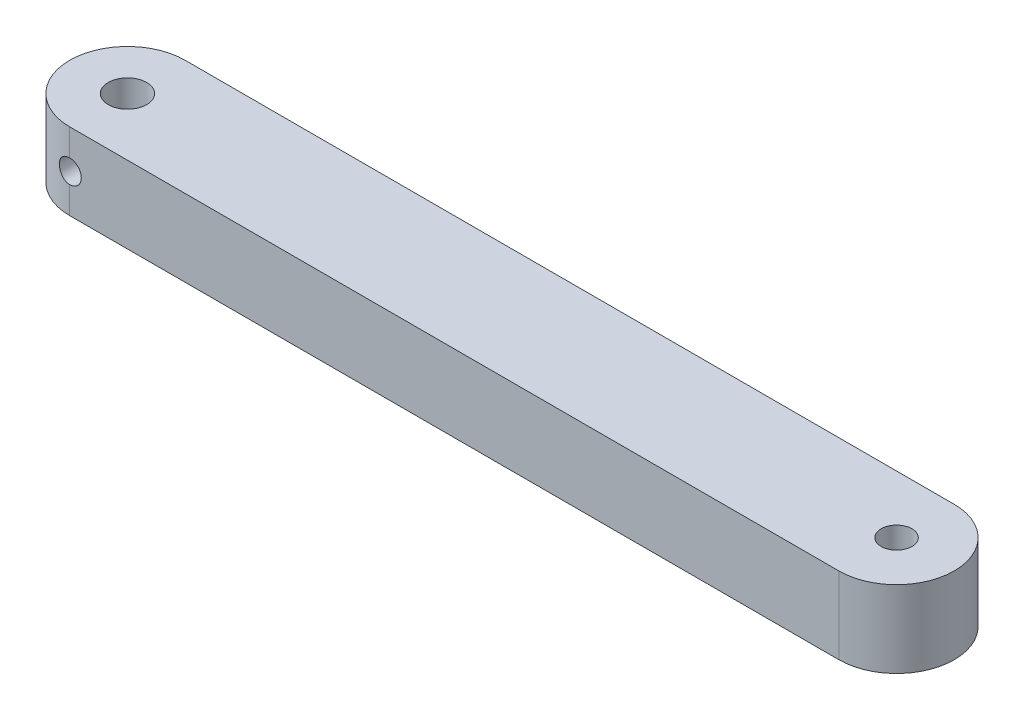
ISO-10303-21;
HEADER;
FILE_DESCRIPTION(('STEP AP214'),'2;1');
FILE_NAME('part.step','',(''),(''),'','','');
FILE_SCHEMA(('AUTOMOTIVE_DESIGN { 1 0 10303 214 1 1 1 1 }'));
ENDSEC;
DATA;
#1=APPLICATION_CONTEXT('core data for automotive mechanical design processes');
#2=APPLICATION_PROTOCOL_DEFINITION('international standard','automotive_design',2000,#1);
#3=PRODUCT_CONTEXT('',#1,'mechanical');
#4=PRODUCT('Part','Part','',(#3));
#5=PRODUCT_RELATED_PRODUCT_CATEGORY('part','',(#4));
#6=PRODUCT_DEFINITION_FORMATION('','',#4);
#7=PRODUCT_DEFINITION_CONTEXT('part definition',#1,'design');
#8=PRODUCT_DEFINITION('design','',#6,#7);
#9=PRODUCT_DEFINITION_SHAPE('','',#8);
#10=(LENGTH_UNIT() NAMED_UNIT(*) SI_UNIT(.MILLI.,.METRE.));
#11=(NAMED_UNIT(*) PLANE_ANGLE_UNIT() SI_UNIT($,.RADIAN.));
#12=(NAMED_UNIT(*) SI_UNIT($,.STERADIAN.) SOLID_ANGLE_UNIT());
#13=UNCERTAINTY_MEASURE_WITH_UNIT(LENGTH_MEASURE(1.E-05),#10,'distance_accuracy_value','');
#14=(GEOMETRIC_REPRESENTATION_CONTEXT(3) GLOBAL_UNCERTAINTY_ASSIGNED_CONTEXT((#13)) GLOBAL_UNIT_ASSIGNED_CONTEXT((#10,
#11,#12)) REPRESENTATION_CONTEXT('',''));
#15=CARTESIAN_POINT('',(0.,0.,0.));
#16=DIRECTION('',(0.,0.,1.));
#17=DIRECTION('',(1.,0.,0.));
#18=AXIS2_PLACEMENT_3D('',#15,#16,#17);
#19=CARTESIAN_POINT('',(0.,10.,0.));
#20=DIRECTION('',(0.,1.,0.));
#21=DIRECTION('',(0.,0.,1.));
#22=AXIS2_PLACEMENT_3D('',#19,#20,#21);
#23=PLANE('',#22);
#24=CARTESIAN_POINT('',(0.,10.,0.));
#25=DIRECTION('',(0.,1.,0.));
#26=DIRECTION('',(0.,0.,1.));
#27=AXIS2_PLACEMENT_3D('',#24,#25,#26);
#28=CIRCLE('',#27,2.5);
#29=CARTESIAN_POINT('',(0.,10.,2.5));
#30=VERTEX_POINT('',#29);
#31=EDGE_CURVE('E138',#30,#30,#28,.T.);
#32=ORIENTED_EDGE('',*,*,#31,.F.);
#33=EDGE_LOOP('',(#32));
#34=FACE_BOUND('',#33,.T.);
#35=CARTESIAN_POINT('',(0.,10.,0.));
#36=DIRECTION('',(0.,1.,0.));
#37=DIRECTION('',(0.,0.,1.));
#38=AXIS2_PLACEMENT_3D('',#35,#36,#37);
#39=CIRCLE('',#38,7.5);
#40=CARTESIAN_POINT('',(0.,10.,-7.5));
#41=VERTEX_POINT('',#40);
#42=CARTESIAN_POINT('',(0.,10.,7.5));
#43=VERTEX_POINT('',#42);
#44=EDGE_CURVE('E117',#41,#43,#39,.T.);
#45=ORIENTED_EDGE('',*,*,#44,.T.);
#46=DIRECTION('',(1.,0.,0.));
#47=VECTOR('',#46,1.);
#48=CARTESIAN_POINT('',(0.,10.,7.5));
#49=LINE('',#48,#47);
#50=CARTESIAN_POINT('',(100.,10.,7.5));
#51=VERTEX_POINT('',#50);
#52=EDGE_CURVE('E110',#43,#51,#49,.T.);
#53=ORIENTED_EDGE('',*,*,#52,.T.);
#54=CARTESIAN_POINT('',(100.,10.,0.));
#55=DIRECTION('',(0.,1.,0.));
#56=DIRECTION('',(0.,0.,1.));
#57=AXIS2_PLACEMENT_3D('',#54,#55,#56);
#58=CIRCLE('',#57,7.5);
#59=CARTESIAN_POINT('',(100.,10.,-7.5));
#60=VERTEX_POINT('',#59);
#61=EDGE_CURVE('E116',#51,#60,#58,.T.);
#62=ORIENTED_EDGE('',*,*,#61,.T.);
#63=DIRECTION('',(-1.,0.,0.));
#64=VECTOR('',#63,1.);
#65=CARTESIAN_POINT('',(0.,10.,-7.5));
#66=LINE('',#65,#64);
#67=EDGE_CURVE('E121',#60,#41,#66,.T.);
#68=ORIENTED_EDGE('',*,*,#67,.T.);
#69=EDGE_LOOP('',(#45,#53,#62,#68));
#70=FACE_BOUND('',#69,.T.);
#71=CARTESIAN_POINT('',(100.,10.,0.));
#72=DIRECTION('',(0.,1.,0.));
#73=DIRECTION('',(0.,0.,1.));
#74=AXIS2_PLACEMENT_3D('',#71,#72,#73);
#75=CIRCLE('',#74,2.);
#76=CARTESIAN_POINT('',(100.,10.,2.));
#77=VERTEX_POINT('',#76);
#78=EDGE_CURVE('E174',#77,#77,#75,.T.);
#79=ORIENTED_EDGE('',*,*,#78,.F.);
#80=EDGE_LOOP('',(#79));
#81=FACE_BOUND('',#80,.T.);
#82=ADVANCED_FACE('F37',(#34,#70,#81),#23,.T.);
#83=CARTESIAN_POINT('',(0.,0.,0.));
#84=DIRECTION('',(0.,1.,0.));
#85=DIRECTION('',(0.,0.,1.));
#86=AXIS2_PLACEMENT_3D('',#83,#84,#85);
#87=PLANE('',#86);
#88=CARTESIAN_POINT('',(0.,0.,0.));
#89=DIRECTION('',(0.,1.,0.));
#90=DIRECTION('',(0.,0.,1.));
#91=AXIS2_PLACEMENT_3D('',#88,#89,#90);
#92=CIRCLE('',#91,7.5);
#93=CARTESIAN_POINT('',(0.,0.,-7.5));
#94=VERTEX_POINT('',#93);
#95=CARTESIAN_POINT('',(0.,0.,7.5));
#96=VERTEX_POINT('',#95);
#97=EDGE_CURVE('E135',#94,#96,#92,.T.);
#98=ORIENTED_EDGE('',*,*,#97,.F.);
#99=DIRECTION('',(-1.,0.,0.));
#100=VECTOR('',#99,1.);
#101=CARTESIAN_POINT('',(0.,0.,-7.5));
#102=LINE('',#101,#100);
#103=CARTESIAN_POINT('',(100.,0.,-7.5));
#104=VERTEX_POINT('',#103);
#105=EDGE_CURVE('E123',#104,#94,#102,.T.);
#106=ORIENTED_EDGE('',*,*,#105,.F.);
#107=CARTESIAN_POINT('',(100.,0.,0.));
#108=DIRECTION('',(0.,1.,0.));
#109=DIRECTION('',(0.,0.,1.));
#110=AXIS2_PLACEMENT_3D('',#107,#108,#109);
#111=CIRCLE('',#110,7.5);
#112=CARTESIAN_POINT('',(100.,0.,7.5));
#113=VERTEX_POINT('',#112);
#114=EDGE_CURVE('E126',#113,#104,#111,.T.);
#115=ORIENTED_EDGE('',*,*,#114,.F.);
#116=DIRECTION('',(1.,0.,0.));
#117=VECTOR('',#116,1.);
#118=CARTESIAN_POINT('',(0.,0.,7.5));
#119=LINE('',#118,#117);
#120=EDGE_CURVE('E137',#96,#113,#119,.T.);
#121=ORIENTED_EDGE('',*,*,#120,.F.);
#122=EDGE_LOOP('',(#98,#106,#115,#121));
#123=FACE_BOUND('',#122,.T.);
#124=CARTESIAN_POINT('',(0.,0.,0.));
#125=DIRECTION('',(0.,1.,0.));
#126=DIRECTION('',(0.,0.,1.));
#127=AXIS2_PLACEMENT_3D('',#124,#125,#126);
#128=CIRCLE('',#127,2.5);
#129=CARTESIAN_POINT('',(0.,0.,2.5));
#130=VERTEX_POINT('',#129);
#131=EDGE_CURVE('E129',#130,#130,#128,.T.);
#132=ORIENTED_EDGE('',*,*,#131,.T.);
#133=EDGE_LOOP('',(#132));
#134=FACE_BOUND('',#133,.T.);
#135=CARTESIAN_POINT('',(100.,0.,0.));
#136=DIRECTION('',(0.,1.,0.));
#137=DIRECTION('',(0.,0.,1.));
#138=AXIS2_PLACEMENT_3D('',#135,#136,#137);
#139=CIRCLE('',#138,2.);
#140=CARTESIAN_POINT('',(100.,0.,2.));
#141=VERTEX_POINT('',#140);
#142=EDGE_CURVE('E173',#141,#141,#139,.T.);
#143=ORIENTED_EDGE('',*,*,#142,.T.);
#144=EDGE_LOOP('',(#143));
#145=FACE_BOUND('',#144,.T.);
#146=ADVANCED_FACE('F184',(#123,#134,#145),#87,.F.);
#147=CARTESIAN_POINT('',(0.,10.,0.));
#148=DIRECTION('',(0.,-1.,0.));
#149=DIRECTION('',(0.,0.,-1.));
#150=AXIS2_PLACEMENT_3D('',#147,#148,#149);
#151=CYLINDRICAL_SURFACE('',#150,7.5);
#152=DIRECTION('',(0.,-1.,0.));
#153=VECTOR('',#152,1.);
#154=CARTESIAN_POINT('',(0.,10.,-7.5));
#155=LINE('',#154,#153);
#156=CARTESIAN_POINT('',(0.,6.5,-7.5));
#157=VERTEX_POINT('',#156);
#158=EDGE_CURVE('E141',#41,#157,#155,.T.);
#159=ORIENTED_EDGE('',*,*,#158,.T.);
#160=CARTESIAN_POINT('',(0.,6.5,-7.5));
#161=CARTESIAN_POINT('',(-0.0417588238806595,6.500000199989,-7.5000019294386));
#162=CARTESIAN_POINT('',(-0.0834972486661915,6.49825509362905,-7.49965080706269));
#163=CARTESIAN_POINT('',(-0.166667522296179,6.49129630867769,-7.49826296747188));
#164=CARTESIAN_POINT('',(-0.208099406878304,6.48608304107254,-7.49722633149222));
#165=CARTESIAN_POINT('',(-0.331355922116846,6.46530640251967,-7.49312528992398));
#166=CARTESIAN_POINT('',(-0.41234239107993,6.44460595029617,-7.48906955781142));
#167=CARTESIAN_POINT('',(-0.569603820370937,6.39013947757882,-7.4787553223484));
#168=CARTESIAN_POINT('',(-0.645878149578835,6.35637171129593,-7.47249652467919));
#169=CARTESIAN_POINT('',(-0.79169781184439,6.27675862254238,-7.4584570747012));
#170=CARTESIAN_POINT('',(-0.861242546045014,6.23091222656068,-7.45067628713854));
#171=CARTESIAN_POINT('',(-0.992538358456238,6.12779449211039,-7.43433285580329));
#172=CARTESIAN_POINT('',(-1.0541857727216,6.07039251915983,-7.42576194229067));
#173=CARTESIAN_POINT('',(-1.16705033226613,5.94606729101681,-7.4088634378278));
#174=CARTESIAN_POINT('',(-1.21826574456214,5.8791424570008,-7.40053588750196));
#175=CARTESIAN_POINT('',(-1.30924897408037,5.73692372632661,-7.38498641183308));
#176=CARTESIAN_POINT('',(-1.34890862443514,5.6615593561885,-7.37777521215949));
#177=CARTESIAN_POINT('',(-1.41495994302328,5.5050727805384,-7.36539373330322));
#178=CARTESIAN_POINT('',(-1.44135365369349,5.42395146356756,-7.36022313997317));
#179=CARTESIAN_POINT('',(-1.47978773053826,5.25937441462128,-7.35259212352478));
#180=CARTESIAN_POINT('',(-1.49201146291305,5.17596314124198,-7.35009710960273));
#181=CARTESIAN_POINT('',(-1.50232823357088,5.00823724495598,-7.34799561720878));
#182=CARTESIAN_POINT('',(-1.50042238657601,4.92392269383542,-7.34838891087016));
#183=CARTESIAN_POINT('',(-1.48268182946398,4.75812951579351,-7.35198827369261));
#184=CARTESIAN_POINT('',(-1.46705770151904,4.6766272946816,-7.3551518162601));
#185=CARTESIAN_POINT('',(-1.42265661080304,4.51742531668611,-7.3638682327755));
#186=CARTESIAN_POINT('',(-1.39387911581566,4.43972571380629,-7.3694212034048));
#187=CARTESIAN_POINT('',(-1.32378662937019,4.28972589268079,-7.38233438253368));
#188=CARTESIAN_POINT('',(-1.28238797044238,4.21746584660487,-7.38970658686288));
#189=CARTESIAN_POINT('',(-1.18828856924967,4.08084163227478,-7.40541955122167));
#190=CARTESIAN_POINT('',(-1.13558689280806,4.01647811734817,-7.41376039128134));
#191=CARTESIAN_POINT('',(-1.01925779239801,3.89626373663883,-7.43065422195608));
#192=CARTESIAN_POINT('',(-0.955451919405018,3.84058558800329,-7.43920833982593));
#193=CARTESIAN_POINT('',(-0.819295069055363,3.74068062625128,-7.45543073341046));
#194=CARTESIAN_POINT('',(-0.746941784477093,3.69645691538805,-7.46309876883295));
#195=CARTESIAN_POINT('',(-0.595541826551299,3.62068308011789,-7.47670503767622));
#196=CARTESIAN_POINT('',(-0.516481347080535,3.5891599043293,-7.4826395856423));
#197=CARTESIAN_POINT('',(-0.35409280389314,3.53993419257239,-7.49207579538012));
#198=CARTESIAN_POINT('',(-0.270771242320029,3.5222112316336,-7.49558105176947));
#199=CARTESIAN_POINT('',(-0.155653296444621,3.50776944402476,-7.49844943296439));
#200=CARTESIAN_POINT('',(-0.124569552760206,3.50485487455971,-7.49903032326109));
#201=CARTESIAN_POINT('',(-0.062328541332932,3.50097259967468,-7.49980526873343));
#202=CARTESIAN_POINT('',(-0.0311714861322037,3.50000161771567,-7.49999997494093));
#203=CARTESIAN_POINT('',(0.,3.5,-7.5));
#204=B_SPLINE_CURVE_WITH_KNOTS('',3,(#160,#161,#162,#163,#164,#165,#166,#167,#168,#169,#170,
#171,#172,#173,#174,#175,#176,#177,#178,#179,#180,#181,#182,#183,#184,#185,#186,#187,#188,#189,
#190,#191,#192,#193,#194,#195,#196,#197,#198,#199,#200,#201,#202,#203),.UNSPECIFIED.,.F.,.F.,(4,
2,2,2,2,2,2,2,2,2,2,2,2,2,2,2,2,2,2,2,2,4),(0.,0.125198255228414,0.250381676775741,
0.500153380174508,0.749958464521305,0.999785758261491,1.25261429602725,1.50548479993728,
1.76065137165548,2.01577864563976,2.26756623950159,2.51933396934624,2.76730321446666,
3.01528249389692,3.26494278906263,3.51462372621779,3.76876744217129,4.02297991712635,
4.27772898721966,4.53210029617248,4.62572822727717,4.71919818514264),.UNSPECIFIED.);
#205=CARTESIAN_POINT('',(0.,3.5,-7.5));
#206=VERTEX_POINT('',#205);
#207=EDGE_CURVE('E66',#157,#206,#204,.T.);
#208=ORIENTED_EDGE('',*,*,#207,.T.);
#209=EDGE_CURVE('E134',#206,#94,#155,.T.);
#210=ORIENTED_EDGE('',*,*,#209,.T.);
#211=ORIENTED_EDGE('',*,*,#97,.T.);
#212=DIRECTION('',(0.,-1.,0.));
#213=VECTOR('',#212,1.);
#214=CARTESIAN_POINT('',(0.,10.,7.5));
#215=LINE('',#214,#213);
#216=CARTESIAN_POINT('',(0.,3.5,7.5));
#217=VERTEX_POINT('',#216);
#218=EDGE_CURVE('E52',#217,#96,#215,.T.);
#219=ORIENTED_EDGE('',*,*,#218,.F.);
#220=CARTESIAN_POINT('',(0.,3.5,7.5));
#221=CARTESIAN_POINT('',(-0.0417588238806586,3.499999800011,7.5000019294386));
#222=CARTESIAN_POINT('',(-0.0834972486661906,3.50174490637095,7.49965080706269));
#223=CARTESIAN_POINT('',(-0.166667522296178,3.50870369132231,7.49826296747188));
#224=CARTESIAN_POINT('',(-0.208099406878303,3.51391695892746,7.49722633149222));
#225=CARTESIAN_POINT('',(-0.331355922116845,3.53469359748033,7.49312528992398));
#226=CARTESIAN_POINT('',(-0.412342391079929,3.55539404970383,7.48906955781142));
#227=CARTESIAN_POINT('',(-0.569603820370936,3.60986052242117,7.4787553223484));
#228=CARTESIAN_POINT('',(-0.645878149578834,3.64362828870407,7.47249652467919));
#229=CARTESIAN_POINT('',(-0.791697811844389,3.72324137745762,7.4584570747012));
#230=CARTESIAN_POINT('',(-0.861242546045013,3.76908777343932,7.45067628713854));
#231=CARTESIAN_POINT('',(-0.992538358456237,3.87220550788961,7.43433285580329));
#232=CARTESIAN_POINT('',(-1.0541857727216,3.92960748084017,7.42576194229067));
#233=CARTESIAN_POINT('',(-1.16705033226613,4.05393270898319,7.4088634378278));
#234=CARTESIAN_POINT('',(-1.21826574456214,4.1208575429992,7.40053588750196));
#235=CARTESIAN_POINT('',(-1.30924897408037,4.26307627367339,7.38498641183308));
#236=CARTESIAN_POINT('',(-1.34890862443514,4.3384406438115,7.37777521215949));
#237=CARTESIAN_POINT('',(-1.41495994302328,4.4949272194616,7.36539373330321));
#238=CARTESIAN_POINT('',(-1.44135365369349,4.57604853643244,7.36022313997317));
#239=CARTESIAN_POINT('',(-1.47978773053826,4.74062558537872,7.35259212352478));
#240=CARTESIAN_POINT('',(-1.49201146291305,4.82403685875801,7.35009710960273));
#241=CARTESIAN_POINT('',(-1.50232823357088,4.99176275504402,7.34799561720878));
#242=CARTESIAN_POINT('',(-1.50042238657601,5.07607730616457,7.34838891087016));
#243=CARTESIAN_POINT('',(-1.48268182946398,5.24187048420649,7.35198827369261));
#244=CARTESIAN_POINT('',(-1.46705770151904,5.3233727053184,7.3551518162601));
#245=CARTESIAN_POINT('',(-1.42265661080304,5.48257468331389,7.3638682327755));
#246=CARTESIAN_POINT('',(-1.39387911581566,5.56027428619371,7.3694212034048));
#247=CARTESIAN_POINT('',(-1.32378662937019,5.71027410731921,7.38233438253368));
#248=CARTESIAN_POINT('',(-1.28238797044238,5.78253415339513,7.38970658686288));
#249=CARTESIAN_POINT('',(-1.18828856924967,5.91915836772522,7.40541955122167));
#250=CARTESIAN_POINT('',(-1.13558689280806,5.98352188265183,7.41376039128134));
#251=CARTESIAN_POINT('',(-1.01925779239801,6.10373626336117,7.43065422195608));
#252=CARTESIAN_POINT('',(-0.955451919405018,6.15941441199671,7.43920833982592));
#253=CARTESIAN_POINT('',(-0.819295069055364,6.25931937374872,7.45543073341046));
#254=CARTESIAN_POINT('',(-0.746941784477093,6.30354308461195,7.46309876883295));
#255=CARTESIAN_POINT('',(-0.5955418265513,6.37931691988211,7.47670503767622));
#256=CARTESIAN_POINT('',(-0.516481347080536,6.4108400956707,7.4826395856423));
#257=CARTESIAN_POINT('',(-0.354092803893141,6.46006580742761,7.49207579538012));
#258=CARTESIAN_POINT('',(-0.27077124232003,6.4777887683664,7.49558105176947));
#259=CARTESIAN_POINT('',(-0.155653296444622,6.49223055597524,7.49844943296439));
#260=CARTESIAN_POINT('',(-0.124569552760206,6.49514512544029,7.49903032326109));
#261=CARTESIAN_POINT('',(-0.0623285413329318,6.49902740032532,7.49980526873343));
#262=CARTESIAN_POINT('',(-0.0311714861322031,6.49999838228433,7.49999997494093));
#263=CARTESIAN_POINT('',(0.,6.5,7.5));
#264=B_SPLINE_CURVE_WITH_KNOTS('',3,(#220,#221,#222,#223,#224,#225,#226,#227,#228,#229,#230,
#231,#232,#233,#234,#235,#236,#237,#238,#239,#240,#241,#242,#243,#244,#245,#246,#247,#248,#249,
#250,#251,#252,#253,#254,#255,#256,#257,#258,#259,#260,#261,#262,#263),.UNSPECIFIED.,.F.,.F.,(4,
2,2,2,2,2,2,2,2,2,2,2,2,2,2,2,2,2,2,2,2,4),(0.,0.125198255228413,0.250381676775741,
0.500153380174507,0.749958464521305,0.999785758261491,1.25261429602725,1.50548479993728,
1.76065137165548,2.01577864563976,2.2675662395016,2.51933396934624,2.76730321446667,
3.01528249389692,3.26494278906263,3.51462372621779,3.76876744217129,4.02297991712635,
4.27772898721966,4.53210029617248,4.62572822727717,4.71919818514264),.UNSPECIFIED.);
#265=CARTESIAN_POINT('',(0.,6.5,7.5));
#266=VERTEX_POINT('',#265);
#267=EDGE_CURVE('E59',#217,#266,#264,.T.);
#268=ORIENTED_EDGE('',*,*,#267,.T.);
#269=EDGE_CURVE('E11',#43,#266,#215,.T.);
#270=ORIENTED_EDGE('',*,*,#269,.F.);
#271=ORIENTED_EDGE('',*,*,#44,.F.);
#272=EDGE_LOOP('',(#159,#208,#210,#211,#219,#268,#270,#271));
#273=FACE_BOUND('',#272,.T.);
#274=ADVANCED_FACE('F39',(#273),#151,.T.);
#275=CARTESIAN_POINT('',(0.,10.,7.5));
#276=DIRECTION('',(0.,0.,-1.));
#277=DIRECTION('',(-1.,0.,0.));
#278=AXIS2_PLACEMENT_3D('',#275,#276,#277);
#279=PLANE('',#278);
#280=ORIENTED_EDGE('',*,*,#269,.T.);
#281=CARTESIAN_POINT('',(0.,5.,7.5));
#282=DIRECTION('',(0.,0.,-1.));
#283=DIRECTION('',(-1.,0.,0.));
#284=AXIS2_PLACEMENT_3D('',#281,#282,#283);
#285=CIRCLE('',#284,1.5);
#286=EDGE_CURVE('E95',#266,#217,#285,.T.);
#287=ORIENTED_EDGE('',*,*,#286,.T.);
#288=ORIENTED_EDGE('',*,*,#218,.T.);
#289=ORIENTED_EDGE('',*,*,#120,.T.);
#290=DIRECTION('',(0.,-1.,0.));
#291=VECTOR('',#290,1.);
#292=CARTESIAN_POINT('',(100.,10.,7.5));
#293=LINE('',#292,#291);
#294=EDGE_CURVE('E113',#51,#113,#293,.T.);
#295=ORIENTED_EDGE('',*,*,#294,.F.);
#296=ORIENTED_EDGE('',*,*,#52,.F.);
#297=EDGE_LOOP('',(#280,#287,#288,#289,#295,#296));
#298=FACE_BOUND('',#297,.T.);
#299=ADVANCED_FACE('F108',(#298),#279,.F.);
#300=CARTESIAN_POINT('',(100.,10.,0.));
#301=DIRECTION('',(0.,-1.,0.));
#302=DIRECTION('',(0.,0.,-1.));
#303=AXIS2_PLACEMENT_3D('',#300,#301,#302);
#304=CYLINDRICAL_SURFACE('',#303,7.5);
#305=ORIENTED_EDGE('',*,*,#114,.T.);
#306=DIRECTION('',(0.,-1.,0.));
#307=VECTOR('',#306,1.);
#308=CARTESIAN_POINT('',(100.,10.,-7.5));
#309=LINE('',#308,#307);
#310=EDGE_CURVE('E143',#60,#104,#309,.T.);
#311=ORIENTED_EDGE('',*,*,#310,.F.);
#312=ORIENTED_EDGE('',*,*,#61,.F.);
#313=ORIENTED_EDGE('',*,*,#294,.T.);
#314=EDGE_LOOP('',(#305,#311,#312,#313));
#315=FACE_BOUND('',#314,.T.);
#316=ADVANCED_FACE('F195',(#315),#304,.T.);
#317=CARTESIAN_POINT('',(0.,10.,-7.5));
#318=DIRECTION('',(0.,0.,1.));
#319=DIRECTION('',(1.,0.,0.));
#320=AXIS2_PLACEMENT_3D('',#317,#318,#319);
#321=PLANE('',#320);
#322=ORIENTED_EDGE('',*,*,#209,.F.);
#323=CARTESIAN_POINT('',(0.,5.,-7.5));
#324=DIRECTION('',(0.,0.,-1.));
#325=DIRECTION('',(-1.,0.,0.));
#326=AXIS2_PLACEMENT_3D('',#323,#324,#325);
#327=CIRCLE('',#326,1.5);
#328=EDGE_CURVE('E100',#157,#206,#327,.T.);
#329=ORIENTED_EDGE('',*,*,#328,.F.);
#330=ORIENTED_EDGE('',*,*,#158,.F.);
#331=ORIENTED_EDGE('',*,*,#67,.F.);
#332=ORIENTED_EDGE('',*,*,#310,.T.);
#333=ORIENTED_EDGE('',*,*,#105,.T.);
#334=EDGE_LOOP('',(#322,#329,#330,#331,#332,#333));
#335=FACE_BOUND('',#334,.T.);
#336=ADVANCED_FACE('F188',(#335),#321,.F.);
#337=CARTESIAN_POINT('',(0.,10.,0.));
#338=DIRECTION('',(0.,-1.,0.));
#339=DIRECTION('',(0.,0.,-1.));
#340=AXIS2_PLACEMENT_3D('',#337,#338,#339);
#341=CYLINDRICAL_SURFACE('',#340,2.5);
#342=CARTESIAN_POINT('',(0.,6.5,-2.5));
#343=CARTESIAN_POINT('',(-0.0767298334620158,6.49999590899012,-2.49999625789732));
#344=CARTESIAN_POINT('',(-0.153582320644178,6.49407132907374,-2.4964290461501));
#345=CARTESIAN_POINT('',(-0.304975509530679,6.47067568048467,-2.48249903608568));
#346=CARTESIAN_POINT('',(-0.379510034596047,6.45317613814578,-2.47211948032719));
#347=CARTESIAN_POINT('',(-0.523751827790837,6.40761363883314,-2.44561558054488));
#348=CARTESIAN_POINT('',(-0.593481028226566,6.37960304183684,-2.42951973272944));
#349=CARTESIAN_POINT('',(-0.727030318214659,6.31413966685897,-2.39295367626407));
#350=CARTESIAN_POINT('',(-0.790851869416383,6.27668923303125,-2.37248455380255));
#351=CARTESIAN_POINT('',(-0.916299278999315,6.19022517329142,-2.32705360719088));
#352=CARTESIAN_POINT('',(-0.977384020081415,6.14054630464861,-2.30186792195985));
#353=CARTESIAN_POINT('',(-1.09088270411891,6.03253279617173,-2.25030439279634));
#354=CARTESIAN_POINT('',(-1.14328534948112,5.97418706281268,-2.22392505153571));
#355=CARTESIAN_POINT('',(-1.24444996762974,5.84207648950327,-2.1691106699591));
#356=CARTESIAN_POINT('',(-1.29197766378809,5.76729822901871,-2.14082017703649));
#357=CARTESIAN_POINT('',(-1.37361437764896,5.60915342675689,-2.08938301412124));
#358=CARTESIAN_POINT('',(-1.4077451733516,5.52580110375243,-2.06622802273938));
#359=CARTESIAN_POINT('',(-1.45440601714221,5.37340354934676,-2.0335462966093));
#360=CARTESIAN_POINT('',(-1.47016197246826,5.30576400138968,-2.02207883137591));
#361=CARTESIAN_POINT('',(-1.49216172340475,5.16819628416964,-2.00590308295503));
#362=CARTESIAN_POINT('',(-1.49841734556836,5.09827107124551,-2.00118639643759));
#363=CARTESIAN_POINT('',(-1.50105508796009,4.95798850578267,-1.99920922463856));
#364=CARTESIAN_POINT('',(-1.49741783408419,4.8876305749068,-2.00196337012718));
#365=CARTESIAN_POINT('',(-1.48046060478828,4.74872122457241,-2.01453261443741));
#366=CARTESIAN_POINT('',(-1.46713334620103,4.68017120415256,-2.02435302432226));
#367=CARTESIAN_POINT('',(-1.43173921881792,4.5474697578719,-2.04953186944258));
#368=CARTESIAN_POINT('',(-1.40978748666087,4.48327294607552,-2.06481711652537));
#369=CARTESIAN_POINT('',(-1.35795061770837,4.35930500907188,-2.09927051350828));
#370=CARTESIAN_POINT('',(-1.32806257259705,4.29953551657608,-2.11844008623465));
#371=CARTESIAN_POINT('',(-1.25517983184583,4.1750159028772,-2.16255327268985));
#372=CARTESIAN_POINT('',(-1.21080724397723,4.11122190704507,-2.18792043372992));
#373=CARTESIAN_POINT('',(-1.11291092784003,3.99132351633298,-2.23930599764381));
#374=CARTESIAN_POINT('',(-1.05937845100579,3.93522656602349,-2.26532500262149));
#375=CARTESIAN_POINT('',(-0.935811834382967,3.82438701817824,-2.31935504958317));
#376=CARTESIAN_POINT('',(-0.864517682704958,3.77092269398401,-2.34713836268532));
#377=CARTESIAN_POINT('',(-0.712276050459001,3.67687795280209,-2.3977242843398));
#378=CARTESIAN_POINT('',(-0.631333763943565,3.63629064621005,-2.42052955425515));
#379=CARTESIAN_POINT('',(-0.467197585268207,3.5720678172041,-2.45730392066151));
#380=CARTESIAN_POINT('',(-0.384467624173581,3.54752464428409,-2.47173957439704));
#381=CARTESIAN_POINT('',(-0.215047895144641,3.51298880259462,-2.4921884281355));
#382=CARTESIAN_POINT('',(-0.12836300566132,3.50297868224643,-2.49821172952738));
#383=CARTESIAN_POINT('',(0.0337146143773953,3.49849215232169,-2.5009057037461));
#384=CARTESIAN_POINT('',(0.109042473418717,3.50209114491483,-2.49873521714286));
#385=CARTESIAN_POINT('',(0.257829401986059,3.52042585307192,-2.48778712087048));
#386=CARTESIAN_POINT('',(0.331288509376105,3.53516134280581,-2.47900964518037));
#387=CARTESIAN_POINT('',(0.472574932157611,3.57454343281246,-2.4559479244219));
#388=CARTESIAN_POINT('',(0.540495750928482,3.59894034907347,-2.44180275662555));
#389=CARTESIAN_POINT('',(0.671265749087261,3.65667737636527,-2.40913880862844));
#390=CARTESIAN_POINT('',(0.734113924963907,3.69001925134667,-2.39061916586511));
#391=CARTESIAN_POINT('',(0.860006262823862,3.7685569792087,-2.3484549623736));
#392=CARTESIAN_POINT('',(0.922394150456835,3.81462382907839,-2.3244780273988));
#393=CARTESIAN_POINT('',(1.03902603131014,3.91539139348862,-2.27474265574732));
#394=CARTESIAN_POINT('',(1.09326040273738,3.97010215485253,-2.2489821658636));
#395=CARTESIAN_POINT('',(1.19931996735579,4.09491039003715,-2.19445423909891));
#396=CARTESIAN_POINT('',(1.24991019630915,4.1660838854655,-2.16573241746291));
#397=CARTESIAN_POINT('',(1.33845238915667,4.3172160245682,-2.1121618206671));
#398=CARTESIAN_POINT('',(1.37641766769781,4.39716529389278,-2.0873089799769));
#399=CARTESIAN_POINT('',(1.43142578795776,4.54624302230669,-2.04984909240519));
#400=CARTESIAN_POINT('',(1.4512162533619,4.61398031235859,-2.03575659328729));
#401=CARTESIAN_POINT('',(1.48113663905972,4.7525320780801,-2.01409605743544));
#402=CARTESIAN_POINT('',(1.49127995297631,4.82334214432783,-2.00651897642721));
#403=CARTESIAN_POINT('',(1.50134130416631,4.96637694759703,-1.99900446616267));
#404=CARTESIAN_POINT('',(1.50122089107869,5.03860599068704,-1.99909576445937));
#405=CARTESIAN_POINT('',(1.49066472959328,5.18189443560946,-2.0069771789285));
#406=CARTESIAN_POINT('',(1.48022337215759,5.25295318008059,-2.0147714813882));
#407=CARTESIAN_POINT('',(1.45040174148913,5.38848841757218,-2.0363318524298));
#408=CARTESIAN_POINT('',(1.43147636845351,5.45311709430687,-2.0497921180558));
#409=CARTESIAN_POINT('',(1.38563242076993,5.57833725447421,-2.08105501960151));
#410=CARTESIAN_POINT('',(1.3587108358848,5.63892720696055,-2.09885929040482));
#411=CARTESIAN_POINT('',(1.29289245555733,5.76431985722078,-2.14012990550916));
#412=CARTESIAN_POINT('',(1.25279167675753,5.82834110385431,-2.16404587582639));
#413=CARTESIAN_POINT('',(1.16375698389085,5.94938007261729,-2.21320127030768));
#414=CARTESIAN_POINT('',(1.11481579607798,6.00639196215255,-2.23844177205021));
#415=CARTESIAN_POINT('',(1.00009777425734,6.12135094913167,-2.29225690291476));
#416=CARTESIAN_POINT('',(0.932876819313907,6.17793107489619,-2.32070308663658));
#417=CARTESIAN_POINT('',(0.788462434445592,6.2790978558633,-2.37365428872367));
#418=CARTESIAN_POINT('',(0.711265444501543,6.32368021198479,-2.39815789310935));
#419=CARTESIAN_POINT('',(0.551125230801457,6.39778580757374,-2.43985578654394));
#420=CARTESIAN_POINT('',(0.468430086957217,6.42772806492683,-2.45725077479787));
#421=CARTESIAN_POINT('',(0.297973306118811,6.47272469521097,-2.48366273001246));
#422=CARTESIAN_POINT('',(0.210232099648615,6.48783516785699,-2.49271125871485));
#423=CARTESIAN_POINT('',(0.101558096917539,6.49669745470866,-2.49802001168187));
#424=CARTESIAN_POINT('',(0.0812762590282795,6.4979344173061,-2.49876114656362));
#425=CARTESIAN_POINT('',(0.0406658206871134,6.49958624637086,-2.49975164517367));
#426=CARTESIAN_POINT('',(0.02033721863757,6.5000010843209,-2.50000099184316));
#427=CARTESIAN_POINT('',(0.,6.5,-2.5));
#428=B_SPLINE_CURVE_WITH_KNOTS('',3,(#342,#343,#344,#345,#346,#347,#348,#349,#350,#351,#352,
#353,#354,#355,#356,#357,#358,#359,#360,#361,#362,#363,#364,#365,#366,#367,#368,#369,#370,#371,
#372,#373,#374,#375,#376,#377,#378,#379,#380,#381,#382,#383,#384,#385,#386,#387,#388,#389,#390,
#391,#392,#393,#394,#395,#396,#397,#398,#399,#400,#401,#402,#403,#404,#405,#406,#407,#408,#409,
#410,#411,#412,#413,#414,#415,#416,#417,#418,#419,#420,#421,#422,#423,#424,#425,#426,#427),
.UNSPECIFIED.,.T.,.F.,(4,2,2,2,2,2,2,2,2,2,2,2,2,2,2,2,2,2,2,2,2,2,2,2,2,2,2,2,2,2,2,2,2,2,2,2,
2,2,2,2,2,2,4),(0.,0.230102237548649,0.460772627520012,0.690308884600012,0.919788197992275,
1.16681590732473,1.414162579348,1.69183813189807,1.96906040692092,2.17933829855633,
2.38935420916578,2.59978170870726,2.81036753273872,3.01823267593207,3.22617409809868,
3.47046995225163,3.71500044803674,3.99360957884691,4.27206939275324,4.53296790696559,
4.79355286918236,5.01875602722426,5.24395461863455,5.46367785689771,5.68344445659025,
5.92601365818361,6.16886690081836,6.44336762428009,6.71757792616455,6.93257787314692,
7.14727888733318,7.36278425777432,7.57840681155724,7.78364098331141,7.98895251523034,
8.22578610052285,8.46281544370207,8.73854311775518,9.01436946031984,9.28175654462676,
9.54812832184448,9.60911473335177,9.6701032602764),.UNSPECIFIED.);
#429=CARTESIAN_POINT('',(0.,6.5,-2.5));
#430=VERTEX_POINT('',#429);
#431=EDGE_CURVE('E42',#430,#430,#428,.T.);
#432=ORIENTED_EDGE('',*,*,#431,.F.);
#433=EDGE_LOOP('',(#432));
#434=FACE_BOUND('',#433,.T.);
#435=CARTESIAN_POINT('',(-1.5,5.,2.));
#436=CARTESIAN_POINT('',(-1.50000404108592,5.07547897528964,1.99999416642511));
#437=CARTESIAN_POINT('',(-1.49426852824014,5.1509384340798,2.00433633903481));
#438=CARTESIAN_POINT('',(-1.47174965152787,5.29932390396222,2.02092590613883));
#439=CARTESIAN_POINT('',(-1.45495475788936,5.3722471873851,2.03318155043097));
#440=CARTESIAN_POINT('',(-1.41143486335795,5.51308364167728,2.0636233903473));
#441=CARTESIAN_POINT('',(-1.3847815450315,5.58102883803527,2.08176666183119));
#442=CARTESIAN_POINT('',(-1.32252909283019,5.71143745336792,2.12185904995836));
#443=CARTESIAN_POINT('',(-1.28692729054693,5.77389922969514,2.14380930122416));
#444=CARTESIAN_POINT('',(-1.20271292747644,5.89994901666408,2.19228594587542));
#445=CARTESIAN_POINT('',(-1.15304179435289,5.96274095712394,2.21904371037662));
#446=CARTESIAN_POINT('',(-1.04426801309985,6.07976476274175,2.2722622943106));
#447=CARTESIAN_POINT('',(-0.985158296729613,6.1339901516708,2.29872287517103));
#448=CARTESIAN_POINT('',(-0.851442367411701,6.2381338097097,2.35175567858734));
#449=CARTESIAN_POINT('',(-0.775851995162548,6.28695446366975,2.37803133577818));
#450=CARTESIAN_POINT('',(-0.615654228271658,6.37080972244443,2.42443786983179));
#451=CARTESIAN_POINT('',(-0.53105519662633,6.40585697412271,2.44457437988735));
#452=CARTESIAN_POINT('',(-0.363771406742666,6.45759592281265,2.4747098780044));
#453=CARTESIAN_POINT('',(-0.281674698130915,6.4757203609673,2.4854930393917));
#454=CARTESIAN_POINT('',(-0.114970509382708,6.49794280286312,2.49874939277545));
#455=CARTESIAN_POINT('',(-0.0303654624001535,6.50205397800006,2.50123038813307));
#456=CARTESIAN_POINT('',(0.12763728373731,6.49638625265754,2.49783372711539));
#457=CARTESIAN_POINT('',(0.201123832865635,6.48826647383069,2.49295437513726));
#458=CARTESIAN_POINT('',(0.345464269151768,6.46152020435189,2.47707997553857));
#459=CARTESIAN_POINT('',(0.416317961051201,6.44289293609285,2.46608447529309));
#460=CARTESIAN_POINT('',(0.55405678046908,6.39583443729622,2.43884907201719));
#461=CARTESIAN_POINT('',(0.620916491037618,6.367346938861,2.42257910450824));
#462=CARTESIAN_POINT('',(0.748988660115611,6.30161538377446,2.38609637638748));
#463=CARTESIAN_POINT('',(0.810199646208011,6.26436905294099,2.36588259201812));
#464=CARTESIAN_POINT('',(0.9330742671432,6.17716090719555,2.32037925976362));
#465=CARTESIAN_POINT('',(0.993918663198194,6.12621168826426,2.2947718295215));
#466=CARTESIAN_POINT('',(1.10671465909275,6.01559588213982,2.24255554245601));
#467=CARTESIAN_POINT('',(1.1586540130834,5.95591749652549,2.21594536703375));
#468=CARTESIAN_POINT('',(1.25824837767417,5.82134659383645,2.16111075123946));
#469=CARTESIAN_POINT('',(1.30470933188632,5.74549242346054,2.13305661385124));
#470=CARTESIAN_POINT('',(1.38397217194232,5.58529376836339,2.08250879557267));
#471=CARTESIAN_POINT('',(1.41679921962189,5.50096528387436,2.0600049029882));
#472=CARTESIAN_POINT('',(1.46077497064842,5.34760636810465,2.02895865196731));
#473=CARTESIAN_POINT('',(1.47527903312665,5.27995936770336,2.01833888618315));
#474=CARTESIAN_POINT('',(1.49480872755284,5.14262638970052,2.00392150777558));
#475=CARTESIAN_POINT('',(1.49984538302907,5.07294287951544,2.00011596115116));
#476=CARTESIAN_POINT('',(1.50014781114183,4.93344831756429,1.99988914321323));
#477=CARTESIAN_POINT('',(1.49540004697659,4.86363722278479,2.00347810223984));
#478=CARTESIAN_POINT('',(1.47640290574941,4.72601265625144,2.01751520788652));
#479=CARTESIAN_POINT('',(1.46214601830139,4.65820080775975,2.02796877613213));
#480=CARTESIAN_POINT('',(1.42488312618657,4.52628542052021,2.054317683331));
#481=CARTESIAN_POINT('',(1.40188805257362,4.46217736346777,2.07020622092812));
#482=CARTESIAN_POINT('',(1.34796261057072,4.33852228426982,2.10571539417587));
#483=CARTESIAN_POINT('',(1.31702924888212,4.278976993634,2.12533743689999));
#484=CARTESIAN_POINT('',(1.24167439558512,4.15475991748775,2.17036819177737));
#485=CARTESIAN_POINT('',(1.19582663060303,4.09109916490343,2.19618239397369));
#486=CARTESIAN_POINT('',(1.09487395518701,3.97171451515054,2.2482175480362));
#487=CARTESIAN_POINT('',(1.03976018672402,3.91599830783088,2.27443886711455));
#488=CARTESIAN_POINT('',(0.913274837212766,3.80677599264957,2.32835625910913));
#489=CARTESIAN_POINT('',(0.840721108780191,3.75449927339416,2.3558007587587));
#490=CARTESIAN_POINT('',(0.686103100868019,3.66309722316335,2.40537639133459));
#491=CARTESIAN_POINT('',(0.604045176134701,3.62396317215908,2.4275110444941));
#492=CARTESIAN_POINT('',(0.438840232972137,3.56313179656863,2.46252280092775));
#493=CARTESIAN_POINT('',(0.356205963651257,3.54037377220889,2.47595588067329));
#494=CARTESIAN_POINT('',(0.187383063890857,3.50928539715374,2.494407389061));
#495=CARTESIAN_POINT('',(0.101198571781968,3.50093870928238,2.49943534582737));
#496=CARTESIAN_POINT('',(-0.0598120232009843,3.49932539141407,2.50040600461976));
#497=CARTESIAN_POINT('',(-0.134620583589706,3.50419666543697,2.49747057186327));
#498=CARTESIAN_POINT('',(-0.282148755978774,3.52489382438162,2.48512948412095));
#499=CARTESIAN_POINT('',(-0.354868344701914,3.5407198313216,2.47572375706639));
#500=CARTESIAN_POINT('',(-0.495145481978797,3.58221957158379,2.45149427526962));
#501=CARTESIAN_POINT('',(-0.562767032608831,3.60773159612924,2.43675966858906));
#502=CARTESIAN_POINT('',(-0.692781971999985,3.66764059455475,2.40303337447155));
#503=CARTESIAN_POINT('',(-0.755174184199832,3.7020395608596,2.38404073252268));
#504=CARTESIAN_POINT('',(-0.880263645295947,3.78292519656876,2.3409343265938));
#505=CARTESIAN_POINT('',(-0.94225869043994,3.83031870901687,2.31648844639149));
#506=CARTESIAN_POINT('',(-1.05789751536307,3.93375303371772,2.26601907350661));
#507=CARTESIAN_POINT('',(-1.11153190956916,3.98980342560791,2.23999385274509));
#508=CARTESIAN_POINT('',(-1.2159097535057,4.1172855621777,2.18528165666204));
#509=CARTESIAN_POINT('',(-1.26542406663368,4.1897664861655,2.15667566270901));
#510=CARTESIAN_POINT('',(-1.35156817210325,4.34348485276654,2.10376464485145));
#511=CARTESIAN_POINT('',(-1.38820466322661,4.42471771398141,2.07945738811052));
#512=CARTESIAN_POINT('',(-1.44437116535132,4.5870642851372,2.0408000304796));
#513=CARTESIAN_POINT('',(-1.46509526060187,4.66759523596125,2.02577665830138));
#514=CARTESIAN_POINT('',(-1.49289268240426,4.83209739470368,2.00539032320036));
#515=CARTESIAN_POINT('',(-1.49999550595837,4.91606076575871,2.00000648744643));
#516=CARTESIAN_POINT('',(-1.5,5.,2.));
#517=B_SPLINE_CURVE_WITH_KNOTS('',3,(#435,#436,#437,#438,#439,#440,#441,#442,#443,#444,#445,
#446,#447,#448,#449,#450,#451,#452,#453,#454,#455,#456,#457,#458,#459,#460,#461,#462,#463,#464,
#465,#466,#467,#468,#469,#470,#471,#472,#473,#474,#475,#476,#477,#478,#479,#480,#481,#482,#483,
#484,#485,#486,#487,#488,#489,#490,#491,#492,#493,#494,#495,#496,#497,#498,#499,#500,#501,#502,
#503,#504,#505,#506,#507,#508,#509,#510,#511,#512,#513,#514,#515,#516),.UNSPECIFIED.,.T.,.F.,(4,
2,2,2,2,2,2,2,2,2,2,2,2,2,2,2,2,2,2,2,2,2,2,2,2,2,2,2,2,2,2,2,2,2,2,2,2,2,2,2,4),(0.,
0.226085249493392,0.45240657433077,0.677113624991876,0.901887762215932,1.15414462390001,
1.40659128601844,1.68630157736223,1.9657544327122,2.21853330858497,2.47107452602766,
2.69230130543182,2.91354445887944,3.13607155036377,3.35865648368878,3.60782810055849,
3.85733966656908,4.13576671140276,4.41367760154768,4.62276298054684,4.83160475643976,
5.04073566011181,5.25003193304128,5.45906724365495,5.66818149154661,5.91499438482002,
6.16204457978454,6.44121828011589,6.72020638384848,6.97891479383337,7.23732973022726,
7.46129321849399,7.68525920139648,7.90563970188756,8.12606965394584,8.37042963549487,
8.61506198741955,8.89071695766604,9.16622832484805,9.41820120134354,9.66962780912277),.UNSPECIFIED.);
#518=CARTESIAN_POINT('',(-1.5,5.,2.));
#519=VERTEX_POINT('',#518);
#520=EDGE_CURVE('E99',#519,#519,#517,.T.);
#521=ORIENTED_EDGE('',*,*,#520,.F.);
#522=EDGE_LOOP('',(#521));
#523=FACE_BOUND('',#522,.T.);
#524=ORIENTED_EDGE('',*,*,#31,.T.);
#525=EDGE_LOOP('',(#524));
#526=FACE_BOUND('',#525,.T.);
#527=ORIENTED_EDGE('',*,*,#131,.F.);
#528=EDGE_LOOP('',(#527));
#529=FACE_BOUND('',#528,.T.);
#530=ADVANCED_FACE('F150',(#434,#523,#526,#529),#341,.F.);
#531=CARTESIAN_POINT('',(100.,10.,0.));
#532=DIRECTION('',(0.,-1.,0.));
#533=DIRECTION('',(0.,0.,-1.));
#534=AXIS2_PLACEMENT_3D('',#531,#532,#533);
#535=CYLINDRICAL_SURFACE('',#534,2.);
#536=ORIENTED_EDGE('',*,*,#78,.T.);
#537=EDGE_LOOP('',(#536));
#538=FACE_BOUND('',#537,.T.);
#539=ORIENTED_EDGE('',*,*,#142,.F.);
#540=EDGE_LOOP('',(#539));
#541=FACE_BOUND('',#540,.T.);
#542=ADVANCED_FACE('F158',(#538,#541),#535,.F.);
#543=CARTESIAN_POINT('',(0.,5.,7.5));
#544=DIRECTION('',(0.,0.,-1.));
#545=DIRECTION('',(-1.,0.,0.));
#546=AXIS2_PLACEMENT_3D('',#543,#544,#545);
#547=CYLINDRICAL_SURFACE('',#546,1.5);
#548=ORIENTED_EDGE('',*,*,#520,.T.);
#549=EDGE_LOOP('',(#548));
#550=FACE_BOUND('',#549,.T.);
#551=ORIENTED_EDGE('',*,*,#286,.F.);
#552=ORIENTED_EDGE('',*,*,#267,.F.);
#553=EDGE_LOOP('',(#551,#552));
#554=FACE_BOUND('',#553,.T.);
#555=ADVANCED_FACE('F96',(#550,#554),#547,.F.);
#556=ORIENTED_EDGE('',*,*,#431,.T.);
#557=EDGE_LOOP('',(#556));
#558=FACE_BOUND('',#557,.T.);
#559=ORIENTED_EDGE('',*,*,#328,.T.);
#560=ORIENTED_EDGE('',*,*,#207,.F.);
#561=EDGE_LOOP('',(#559,#560));
#562=FACE_BOUND('',#561,.T.);
#563=ADVANCED_FACE('F154',(#558,#562),#547,.F.);
#564=CLOSED_SHELL('',(#82,#146,#274,#299,#316,#336,#530,#542,#555,#563));
#565=MANIFOLD_SOLID_BREP('B2',#564);
#566=ADVANCED_BREP_SHAPE_REPRESENTATION('',(#18,#565),#14);
#567=SHAPE_DEFINITION_REPRESENTATION(#9,#566);
ENDSEC;
END-ISO-10303-21;
